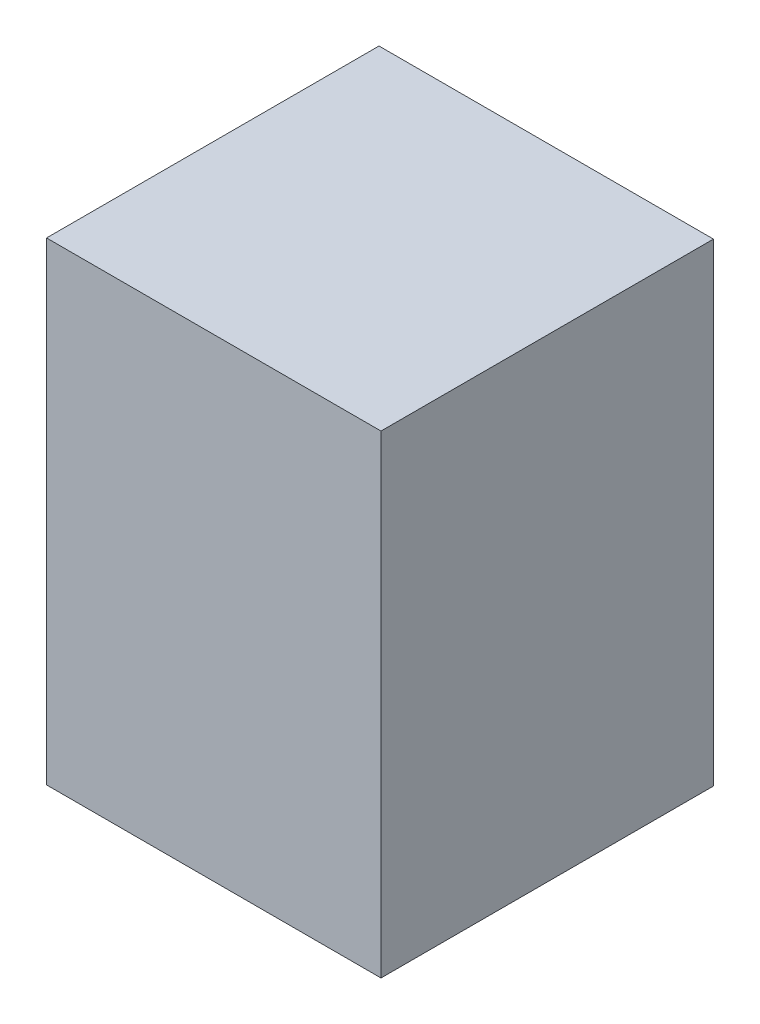
ISO-10303-21;
HEADER;
FILE_DESCRIPTION(('STEP AP214'),'2;1');
FILE_NAME('part.step','',(''),(''),'','','');
FILE_SCHEMA(('AUTOMOTIVE_DESIGN { 1 0 10303 214 1 1 1 1 }'));
ENDSEC;
DATA;
#1=APPLICATION_CONTEXT('core data for automotive mechanical design processes');
#2=APPLICATION_PROTOCOL_DEFINITION('international standard','automotive_design',2000,#1);
#3=PRODUCT_CONTEXT('',#1,'mechanical');
#4=PRODUCT('Part','Part','',(#3));
#5=PRODUCT_RELATED_PRODUCT_CATEGORY('part','',(#4));
#6=PRODUCT_DEFINITION_FORMATION('','',#4);
#7=PRODUCT_DEFINITION_CONTEXT('part definition',#1,'design');
#8=PRODUCT_DEFINITION('design','',#6,#7);
#9=PRODUCT_DEFINITION_SHAPE('','',#8);
#10=(LENGTH_UNIT() NAMED_UNIT(*) SI_UNIT(.MILLI.,.METRE.));
#11=(NAMED_UNIT(*) PLANE_ANGLE_UNIT() SI_UNIT($,.RADIAN.));
#12=(NAMED_UNIT(*) SI_UNIT($,.STERADIAN.) SOLID_ANGLE_UNIT());
#13=UNCERTAINTY_MEASURE_WITH_UNIT(LENGTH_MEASURE(1.E-05),#10,'distance_accuracy_value','');
#14=(GEOMETRIC_REPRESENTATION_CONTEXT(3) GLOBAL_UNCERTAINTY_ASSIGNED_CONTEXT((#13)) GLOBAL_UNIT_ASSIGNED_CONTEXT((#10,
#11,#12)) REPRESENTATION_CONTEXT('',''));
#15=CARTESIAN_POINT('',(0.,0.,0.));
#16=DIRECTION('',(0.,0.,1.));
#17=DIRECTION('',(1.,0.,0.));
#18=AXIS2_PLACEMENT_3D('',#15,#16,#17);
#19=CARTESIAN_POINT('',(-0.4023995,0.56994298,0.80000094));
#20=DIRECTION('',(0.,0.,-1.));
#21=DIRECTION('',(0.,-1.,0.));
#22=AXIS2_PLACEMENT_3D('',#19,#20,#21);
#23=PLANE('',#22);
#24=DIRECTION('',(0.,-1.,0.));
#25=VECTOR('',#24,1.);
#26=CARTESIAN_POINT('',(-0.4023995,0.56994298,0.80000094));
#27=LINE('',#26,#25);
#28=CARTESIAN_POINT('',(-0.4023995,0.56994298,0.80000094));
#29=VERTEX_POINT('',#28);
#30=CARTESIAN_POINT('',(-0.4023995,-0.56994298,0.80000094));
#31=VERTEX_POINT('',#30);
#32=EDGE_CURVE('E96',#29,#31,#27,.T.);
#33=ORIENTED_EDGE('',*,*,#32,.T.);
#34=DIRECTION('',(1.,0.,0.));
#35=VECTOR('',#34,1.);
#36=CARTESIAN_POINT('',(-0.4023995,-0.56994298,0.80000094));
#37=LINE('',#36,#35);
#38=CARTESIAN_POINT('',(0.4023995,-0.56994298,0.80000094));
#39=VERTEX_POINT('',#38);
#40=EDGE_CURVE('E76',#31,#39,#37,.T.);
#41=ORIENTED_EDGE('',*,*,#40,.T.);
#42=DIRECTION('',(0.,1.,0.));
#43=VECTOR('',#42,1.);
#44=CARTESIAN_POINT('',(0.4023995,-0.56994298,0.80000094));
#45=LINE('',#44,#43);
#46=CARTESIAN_POINT('',(0.4023995,0.56994298,0.80000094));
#47=VERTEX_POINT('',#46);
#48=EDGE_CURVE('E21',#39,#47,#45,.T.);
#49=ORIENTED_EDGE('',*,*,#48,.T.);
#50=DIRECTION('',(-1.,0.,0.));
#51=VECTOR('',#50,1.);
#52=CARTESIAN_POINT('',(0.4023995,0.56994298,0.80000094));
#53=LINE('',#52,#51);
#54=EDGE_CURVE('E11',#47,#29,#53,.T.);
#55=ORIENTED_EDGE('',*,*,#54,.T.);
#56=EDGE_LOOP('',(#33,#41,#49,#55));
#57=FACE_BOUND('',#56,.T.);
#58=ADVANCED_FACE('F17',(#57),#23,.F.);
#59=CARTESIAN_POINT('',(-0.4023995,0.56994298,0.));
#60=DIRECTION('',(0.,0.,-1.));
#61=DIRECTION('',(0.,-1.,0.));
#62=AXIS2_PLACEMENT_3D('',#59,#60,#61);
#63=PLANE('',#62);
#64=DIRECTION('',(-1.,0.,0.));
#65=VECTOR('',#64,1.);
#66=CARTESIAN_POINT('',(0.4023995,0.56994298,0.));
#67=LINE('',#66,#65);
#68=CARTESIAN_POINT('',(0.4023995,0.56994298,0.));
#69=VERTEX_POINT('',#68);
#70=CARTESIAN_POINT('',(-0.4023995,0.56994298,0.));
#71=VERTEX_POINT('',#70);
#72=EDGE_CURVE('E27',#69,#71,#67,.T.);
#73=ORIENTED_EDGE('',*,*,#72,.F.);
#74=DIRECTION('',(0.,1.,0.));
#75=VECTOR('',#74,1.);
#76=CARTESIAN_POINT('',(0.4023995,-0.56994298,0.));
#77=LINE('',#76,#75);
#78=CARTESIAN_POINT('',(0.4023995,-0.56994298,0.));
#79=VERTEX_POINT('',#78);
#80=EDGE_CURVE('E67',#79,#69,#77,.T.);
#81=ORIENTED_EDGE('',*,*,#80,.F.);
#82=DIRECTION('',(1.,0.,0.));
#83=VECTOR('',#82,1.);
#84=CARTESIAN_POINT('',(-0.4023995,-0.56994298,0.));
#85=LINE('',#84,#83);
#86=CARTESIAN_POINT('',(-0.4023995,-0.56994298,0.));
#87=VERTEX_POINT('',#86);
#88=EDGE_CURVE('E70',#87,#79,#85,.T.);
#89=ORIENTED_EDGE('',*,*,#88,.F.);
#90=DIRECTION('',(0.,-1.,0.));
#91=VECTOR('',#90,1.);
#92=CARTESIAN_POINT('',(-0.4023995,0.56994298,0.));
#93=LINE('',#92,#91);
#94=EDGE_CURVE('E111',#71,#87,#93,.T.);
#95=ORIENTED_EDGE('',*,*,#94,.F.);
#96=EDGE_LOOP('',(#73,#81,#89,#95));
#97=FACE_BOUND('',#96,.T.);
#98=ADVANCED_FACE('F19',(#97),#63,.T.);
#99=CARTESIAN_POINT('',(0.4023995,0.56994298,0.));
#100=DIRECTION('',(0.,-1.,0.));
#101=DIRECTION('',(0.,0.,-1.));
#102=AXIS2_PLACEMENT_3D('',#99,#100,#101);
#103=PLANE('',#102);
#104=ORIENTED_EDGE('',*,*,#72,.T.);
#105=DIRECTION('',(0.,0.,1.));
#106=VECTOR('',#105,1.);
#107=CARTESIAN_POINT('',(-0.4023995,0.56994298,0.));
#108=LINE('',#107,#106);
#109=EDGE_CURVE('E90',#71,#29,#108,.T.);
#110=ORIENTED_EDGE('',*,*,#109,.T.);
#111=ORIENTED_EDGE('',*,*,#54,.F.);
#112=DIRECTION('',(0.,0.,1.));
#113=VECTOR('',#112,1.);
#114=CARTESIAN_POINT('',(0.4023995,0.56994298,0.));
#115=LINE('',#114,#113);
#116=EDGE_CURVE('E75',#69,#47,#115,.T.);
#117=ORIENTED_EDGE('',*,*,#116,.F.);
#118=EDGE_LOOP('',(#104,#110,#111,#117));
#119=FACE_BOUND('',#118,.T.);
#120=ADVANCED_FACE('F181',(#119),#103,.F.);
#121=CARTESIAN_POINT('',(0.4023995,-0.56994298,0.));
#122=DIRECTION('',(-1.,0.,0.));
#123=DIRECTION('',(0.,0.,1.));
#124=AXIS2_PLACEMENT_3D('',#121,#122,#123);
#125=PLANE('',#124);
#126=ORIENTED_EDGE('',*,*,#80,.T.);
#127=ORIENTED_EDGE('',*,*,#116,.T.);
#128=ORIENTED_EDGE('',*,*,#48,.F.);
#129=DIRECTION('',(0.,0.,1.));
#130=VECTOR('',#129,1.);
#131=CARTESIAN_POINT('',(0.4023995,-0.56994298,0.));
#132=LINE('',#131,#130);
#133=EDGE_CURVE('E79',#79,#39,#132,.T.);
#134=ORIENTED_EDGE('',*,*,#133,.F.);
#135=EDGE_LOOP('',(#126,#127,#128,#134));
#136=FACE_BOUND('',#135,.T.);
#137=ADVANCED_FACE('F80',(#136),#125,.F.);
#138=CARTESIAN_POINT('',(-0.4023995,-0.56994298,0.));
#139=DIRECTION('',(0.,1.,0.));
#140=DIRECTION('',(1.,0.,0.));
#141=AXIS2_PLACEMENT_3D('',#138,#139,#140);
#142=PLANE('',#141);
#143=ORIENTED_EDGE('',*,*,#88,.T.);
#144=ORIENTED_EDGE('',*,*,#133,.T.);
#145=ORIENTED_EDGE('',*,*,#40,.F.);
#146=DIRECTION('',(0.,0.,1.));
#147=VECTOR('',#146,1.);
#148=CARTESIAN_POINT('',(-0.4023995,-0.56994298,0.));
#149=LINE('',#148,#147);
#150=EDGE_CURVE('E87',#87,#31,#149,.T.);
#151=ORIENTED_EDGE('',*,*,#150,.F.);
#152=EDGE_LOOP('',(#143,#144,#145,#151));
#153=FACE_BOUND('',#152,.T.);
#154=ADVANCED_FACE('F85',(#153),#142,.F.);
#155=CARTESIAN_POINT('',(-0.4023995,0.56994298,0.));
#156=DIRECTION('',(1.,0.,0.));
#157=DIRECTION('',(0.,1.,0.));
#158=AXIS2_PLACEMENT_3D('',#155,#156,#157);
#159=PLANE('',#158);
#160=ORIENTED_EDGE('',*,*,#94,.T.);
#161=ORIENTED_EDGE('',*,*,#150,.T.);
#162=ORIENTED_EDGE('',*,*,#32,.F.);
#163=ORIENTED_EDGE('',*,*,#109,.F.);
#164=EDGE_LOOP('',(#160,#161,#162,#163));
#165=FACE_BOUND('',#164,.T.);
#166=ADVANCED_FACE('F110',(#165),#159,.F.);
#167=CLOSED_SHELL('',(#58,#98,#120,#137,#154,#166));
#168=MANIFOLD_SOLID_BREP('B1',#167);
#169=ADVANCED_BREP_SHAPE_REPRESENTATION('',(#18,#168),#14);
#170=SHAPE_DEFINITION_REPRESENTATION(#9,#169);
ENDSEC;
END-ISO-10303-21;
